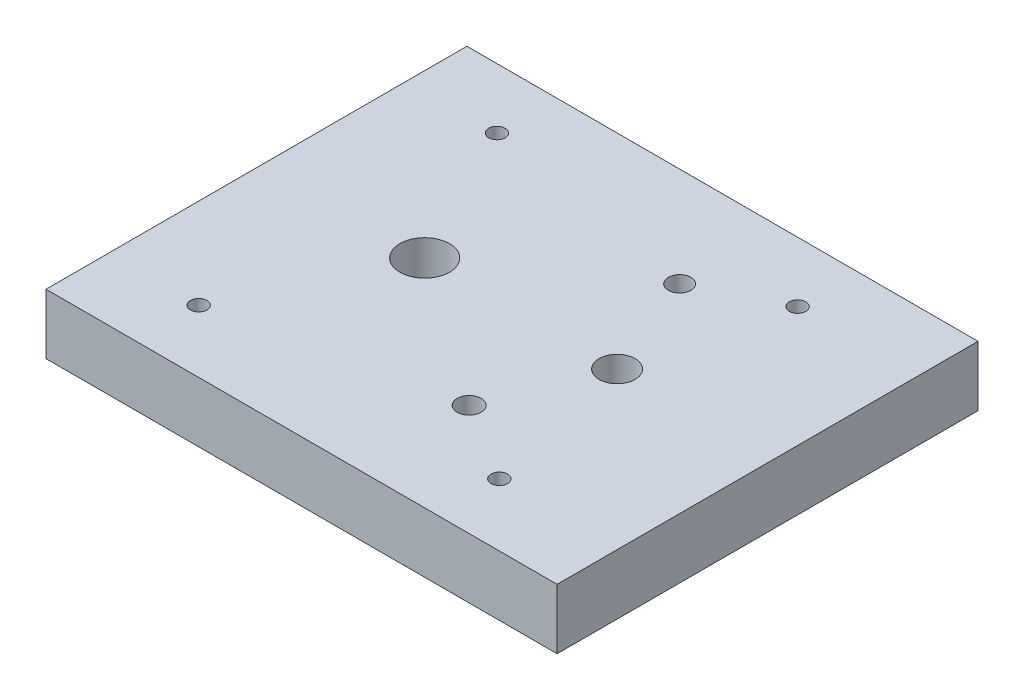
ISO-10303-21;
HEADER;
FILE_DESCRIPTION(('STEP AP214'),'2;1');
FILE_NAME('part.step','',(''),(''),'','','');
FILE_SCHEMA(('AUTOMOTIVE_DESIGN { 1 0 10303 214 1 1 1 1 }'));
ENDSEC;
DATA;
#1=APPLICATION_CONTEXT('core data for automotive mechanical design processes');
#2=APPLICATION_PROTOCOL_DEFINITION('international standard','automotive_design',2000,#1);
#3=PRODUCT_CONTEXT('',#1,'mechanical');
#4=PRODUCT('Part','Part','',(#3));
#5=PRODUCT_RELATED_PRODUCT_CATEGORY('part','',(#4));
#6=PRODUCT_DEFINITION_FORMATION('','',#4);
#7=PRODUCT_DEFINITION_CONTEXT('part definition',#1,'design');
#8=PRODUCT_DEFINITION('design','',#6,#7);
#9=PRODUCT_DEFINITION_SHAPE('','',#8);
#10=(LENGTH_UNIT() NAMED_UNIT(*) SI_UNIT(.MILLI.,.METRE.));
#11=(NAMED_UNIT(*) PLANE_ANGLE_UNIT() SI_UNIT($,.RADIAN.));
#12=(NAMED_UNIT(*) SI_UNIT($,.STERADIAN.) SOLID_ANGLE_UNIT());
#13=UNCERTAINTY_MEASURE_WITH_UNIT(LENGTH_MEASURE(1.E-05),#10,'distance_accuracy_value','');
#14=(GEOMETRIC_REPRESENTATION_CONTEXT(3) GLOBAL_UNCERTAINTY_ASSIGNED_CONTEXT((#13)) GLOBAL_UNIT_ASSIGNED_CONTEXT((#10,
#11,#12)) REPRESENTATION_CONTEXT('',''));
#15=CARTESIAN_POINT('',(0.,0.,0.));
#16=DIRECTION('',(0.,0.,1.));
#17=DIRECTION('',(1.,0.,0.));
#18=AXIS2_PLACEMENT_3D('',#15,#16,#17);
#19=CARTESIAN_POINT('',(42.5,10.,0.));
#20=DIRECTION('',(1.,0.,0.));
#21=DIRECTION('',(0.,0.,-1.));
#22=AXIS2_PLACEMENT_3D('',#19,#20,#21);
#23=PLANE('',#22);
#24=DIRECTION('',(0.,0.,1.));
#25=VECTOR('',#24,1.);
#26=CARTESIAN_POINT('',(42.5,0.,0.));
#27=LINE('',#26,#25);
#28=CARTESIAN_POINT('',(42.5,0.,-35.));
#29=VERTEX_POINT('',#28);
#30=CARTESIAN_POINT('',(42.5,0.,35.));
#31=VERTEX_POINT('',#30);
#32=EDGE_CURVE('E150',#29,#31,#27,.T.);
#33=ORIENTED_EDGE('',*,*,#32,.F.);
#34=DIRECTION('',(0.,-1.,0.));
#35=VECTOR('',#34,1.);
#36=CARTESIAN_POINT('',(42.5,10.,-35.));
#37=LINE('',#36,#35);
#38=CARTESIAN_POINT('',(42.5,10.,-35.));
#39=VERTEX_POINT('',#38);
#40=EDGE_CURVE('E11',#39,#29,#37,.T.);
#41=ORIENTED_EDGE('',*,*,#40,.F.);
#42=DIRECTION('',(0.,0.,1.));
#43=VECTOR('',#42,1.);
#44=CARTESIAN_POINT('',(42.5,10.,0.));
#45=LINE('',#44,#43);
#46=CARTESIAN_POINT('',(42.5,10.,35.));
#47=VERTEX_POINT('',#46);
#48=EDGE_CURVE('E108',#39,#47,#45,.T.);
#49=ORIENTED_EDGE('',*,*,#48,.T.);
#50=DIRECTION('',(0.,-1.,0.));
#51=VECTOR('',#50,1.);
#52=CARTESIAN_POINT('',(42.5,10.,35.));
#53=LINE('',#52,#51);
#54=EDGE_CURVE('E83',#47,#31,#53,.T.);
#55=ORIENTED_EDGE('',*,*,#54,.T.);
#56=EDGE_LOOP('',(#33,#41,#49,#55));
#57=FACE_BOUND('',#56,.T.);
#58=ADVANCED_FACE('F41',(#57),#23,.T.);
#59=CARTESIAN_POINT('',(0.,10.,-35.));
#60=DIRECTION('',(0.,0.,-1.));
#61=DIRECTION('',(-1.,0.,0.));
#62=AXIS2_PLACEMENT_3D('',#59,#60,#61);
#63=PLANE('',#62);
#64=DIRECTION('',(1.,0.,0.));
#65=VECTOR('',#64,1.);
#66=CARTESIAN_POINT('',(0.,0.,-35.));
#67=LINE('',#66,#65);
#68=CARTESIAN_POINT('',(-42.5,0.,-35.));
#69=VERTEX_POINT('',#68);
#70=EDGE_CURVE('E95',#69,#29,#67,.T.);
#71=ORIENTED_EDGE('',*,*,#70,.F.);
#72=DIRECTION('',(0.,-1.,0.));
#73=VECTOR('',#72,1.);
#74=CARTESIAN_POINT('',(-42.5,10.,-35.));
#75=LINE('',#74,#73);
#76=CARTESIAN_POINT('',(-42.5,10.,-35.));
#77=VERTEX_POINT('',#76);
#78=EDGE_CURVE('E52',#77,#69,#75,.T.);
#79=ORIENTED_EDGE('',*,*,#78,.F.);
#80=DIRECTION('',(1.,0.,0.));
#81=VECTOR('',#80,1.);
#82=CARTESIAN_POINT('',(0.,10.,-35.));
#83=LINE('',#82,#81);
#84=EDGE_CURVE('E93',#77,#39,#83,.T.);
#85=ORIENTED_EDGE('',*,*,#84,.T.);
#86=ORIENTED_EDGE('',*,*,#40,.T.);
#87=EDGE_LOOP('',(#71,#79,#85,#86));
#88=FACE_BOUND('',#87,.T.);
#89=ADVANCED_FACE('F91',(#88),#63,.T.);
#90=CARTESIAN_POINT('',(-42.5,10.,0.));
#91=DIRECTION('',(1.,0.,0.));
#92=DIRECTION('',(0.,0.,-1.));
#93=AXIS2_PLACEMENT_3D('',#90,#91,#92);
#94=PLANE('',#93);
#95=DIRECTION('',(0.,0.,1.));
#96=VECTOR('',#95,1.);
#97=CARTESIAN_POINT('',(-42.5,0.,0.));
#98=LINE('',#97,#96);
#99=CARTESIAN_POINT('',(-42.5,0.,35.));
#100=VERTEX_POINT('',#99);
#101=EDGE_CURVE('E155',#69,#100,#98,.T.);
#102=ORIENTED_EDGE('',*,*,#101,.T.);
#103=DIRECTION('',(0.,-1.,0.));
#104=VECTOR('',#103,1.);
#105=CARTESIAN_POINT('',(-42.5,10.,35.));
#106=LINE('',#105,#104);
#107=CARTESIAN_POINT('',(-42.5,10.,35.));
#108=VERTEX_POINT('',#107);
#109=EDGE_CURVE('E99',#108,#100,#106,.T.);
#110=ORIENTED_EDGE('',*,*,#109,.F.);
#111=DIRECTION('',(0.,0.,1.));
#112=VECTOR('',#111,1.);
#113=CARTESIAN_POINT('',(-42.5,10.,0.));
#114=LINE('',#113,#112);
#115=EDGE_CURVE('E102',#77,#108,#114,.T.);
#116=ORIENTED_EDGE('',*,*,#115,.F.);
#117=ORIENTED_EDGE('',*,*,#78,.T.);
#118=EDGE_LOOP('',(#102,#110,#116,#117));
#119=FACE_BOUND('',#118,.T.);
#120=ADVANCED_FACE('F103',(#119),#94,.F.);
#121=CARTESIAN_POINT('',(-15.52,10.,-0.999999999999982));
#122=DIRECTION('',(0.,-1.,0.));
#123=DIRECTION('',(0.,0.,-1.));
#124=AXIS2_PLACEMENT_3D('',#121,#122,#123);
#125=CYLINDRICAL_SURFACE('',#124,4.125);
#126=CARTESIAN_POINT('',(-15.52,10.,-0.999999999999982));
#127=DIRECTION('',(0.,1.,0.));
#128=DIRECTION('',(0.,0.,1.));
#129=AXIS2_PLACEMENT_3D('',#126,#127,#128);
#130=CIRCLE('',#129,4.125);
#131=CARTESIAN_POINT('',(-15.52,10.,3.12500000000002));
#132=VERTEX_POINT('',#131);
#133=EDGE_CURVE('E122',#132,#132,#130,.T.);
#134=ORIENTED_EDGE('',*,*,#133,.T.);
#135=EDGE_LOOP('',(#134));
#136=FACE_BOUND('',#135,.T.);
#137=CARTESIAN_POINT('',(-15.52,0.,-0.999999999999982));
#138=DIRECTION('',(0.,1.,0.));
#139=DIRECTION('',(0.,0.,1.));
#140=AXIS2_PLACEMENT_3D('',#137,#138,#139);
#141=CIRCLE('',#140,4.125);
#142=CARTESIAN_POINT('',(-15.52,0.,3.12500000000002));
#143=VERTEX_POINT('',#142);
#144=EDGE_CURVE('E164',#143,#143,#141,.T.);
#145=ORIENTED_EDGE('',*,*,#144,.F.);
#146=EDGE_LOOP('',(#145));
#147=FACE_BOUND('',#146,.T.);
#148=ADVANCED_FACE('F237',(#136,#147),#125,.F.);
#149=CARTESIAN_POINT('',(-27.5,10.,24.6066772895717));
#150=DIRECTION('',(0.,-1.,0.));
#151=DIRECTION('',(0.,0.,-1.));
#152=AXIS2_PLACEMENT_3D('',#149,#150,#151);
#153=CYLINDRICAL_SURFACE('',#152,1.375);
#154=CARTESIAN_POINT('',(-27.5,10.,24.6066772895717));
#155=DIRECTION('',(0.,1.,0.));
#156=DIRECTION('',(0.,0.,1.));
#157=AXIS2_PLACEMENT_3D('',#154,#155,#156);
#158=CIRCLE('',#157,1.375);
#159=CARTESIAN_POINT('',(-27.5,10.,25.9816772895717));
#160=VERTEX_POINT('',#159);
#161=EDGE_CURVE('E118',#160,#160,#158,.F.);
#162=ORIENTED_EDGE('',*,*,#161,.F.);
#163=EDGE_LOOP('',(#162));
#164=FACE_BOUND('',#163,.T.);
#165=CARTESIAN_POINT('',(-27.5,0.,24.6066772895717));
#166=DIRECTION('',(0.,1.,0.));
#167=DIRECTION('',(0.,0.,1.));
#168=AXIS2_PLACEMENT_3D('',#165,#166,#167);
#169=CIRCLE('',#168,1.375);
#170=CARTESIAN_POINT('',(-27.5,0.,25.9816772895717));
#171=VERTEX_POINT('',#170);
#172=EDGE_CURVE('E160',#171,#171,#169,.F.);
#173=ORIENTED_EDGE('',*,*,#172,.T.);
#174=EDGE_LOOP('',(#173));
#175=FACE_BOUND('',#174,.T.);
#176=ADVANCED_FACE('F240',(#164,#175),#153,.F.);
#177=CARTESIAN_POINT('',(0.,10.,35.));
#178=DIRECTION('',(0.,0.,-1.));
#179=DIRECTION('',(-1.,0.,0.));
#180=AXIS2_PLACEMENT_3D('',#177,#178,#179);
#181=PLANE('',#180);
#182=DIRECTION('',(1.,0.,0.));
#183=VECTOR('',#182,1.);
#184=CARTESIAN_POINT('',(0.,0.,35.));
#185=LINE('',#184,#183);
#186=EDGE_CURVE('E76',#100,#31,#185,.T.);
#187=ORIENTED_EDGE('',*,*,#186,.T.);
#188=ORIENTED_EDGE('',*,*,#54,.F.);
#189=DIRECTION('',(1.,0.,0.));
#190=VECTOR('',#189,1.);
#191=CARTESIAN_POINT('',(0.,10.,35.));
#192=LINE('',#191,#190);
#193=EDGE_CURVE('E60',#108,#47,#192,.T.);
#194=ORIENTED_EDGE('',*,*,#193,.F.);
#195=ORIENTED_EDGE('',*,*,#109,.T.);
#196=EDGE_LOOP('',(#187,#188,#194,#195));
#197=FACE_BOUND('',#196,.T.);
#198=ADVANCED_FACE('F173',(#197),#181,.F.);
#199=CARTESIAN_POINT('',(-27.5,10.,-25.));
#200=DIRECTION('',(0.,-1.,0.));
#201=DIRECTION('',(0.,0.,-1.));
#202=AXIS2_PLACEMENT_3D('',#199,#200,#201);
#203=CYLINDRICAL_SURFACE('',#202,1.375);
#204=CARTESIAN_POINT('',(-27.5,10.,-25.));
#205=DIRECTION('',(0.,1.,0.));
#206=DIRECTION('',(0.,0.,1.));
#207=AXIS2_PLACEMENT_3D('',#204,#205,#206);
#208=CIRCLE('',#207,1.375);
#209=CARTESIAN_POINT('',(-27.5,10.,-23.625));
#210=VERTEX_POINT('',#209);
#211=EDGE_CURVE('E112',#210,#210,#208,.T.);
#212=ORIENTED_EDGE('',*,*,#211,.T.);
#213=EDGE_LOOP('',(#212));
#214=FACE_BOUND('',#213,.T.);
#215=CARTESIAN_POINT('',(-27.5,0.,-25.));
#216=DIRECTION('',(0.,1.,0.));
#217=DIRECTION('',(0.,0.,1.));
#218=AXIS2_PLACEMENT_3D('',#215,#216,#217);
#219=CIRCLE('',#218,1.375);
#220=CARTESIAN_POINT('',(-27.5,0.,-23.625));
#221=VERTEX_POINT('',#220);
#222=EDGE_CURVE('E146',#221,#221,#219,.T.);
#223=ORIENTED_EDGE('',*,*,#222,.F.);
#224=EDGE_LOOP('',(#223));
#225=FACE_BOUND('',#224,.T.);
#226=ADVANCED_FACE('F184',(#214,#225),#203,.F.);
#227=CARTESIAN_POINT('',(22.5,10.,-25.));
#228=DIRECTION('',(0.,-1.,0.));
#229=DIRECTION('',(0.,0.,-1.));
#230=AXIS2_PLACEMENT_3D('',#227,#228,#229);
#231=CYLINDRICAL_SURFACE('',#230,1.375);
#232=CARTESIAN_POINT('',(22.5,10.,-25.));
#233=DIRECTION('',(0.,1.,0.));
#234=DIRECTION('',(0.,0.,1.));
#235=AXIS2_PLACEMENT_3D('',#232,#233,#234);
#236=CIRCLE('',#235,1.375);
#237=CARTESIAN_POINT('',(22.5,10.,-23.625));
#238=VERTEX_POINT('',#237);
#239=EDGE_CURVE('E346',#238,#238,#236,.T.);
#240=ORIENTED_EDGE('',*,*,#239,.T.);
#241=EDGE_LOOP('',(#240));
#242=FACE_BOUND('',#241,.T.);
#243=CARTESIAN_POINT('',(22.5,0.,-25.));
#244=DIRECTION('',(0.,1.,0.));
#245=DIRECTION('',(0.,0.,1.));
#246=AXIS2_PLACEMENT_3D('',#243,#244,#245);
#247=CIRCLE('',#246,1.375);
#248=CARTESIAN_POINT('',(22.5,0.,-23.625));
#249=VERTEX_POINT('',#248);
#250=EDGE_CURVE('E142',#249,#249,#247,.T.);
#251=ORIENTED_EDGE('',*,*,#250,.F.);
#252=EDGE_LOOP('',(#251));
#253=FACE_BOUND('',#252,.T.);
#254=ADVANCED_FACE('F187',(#242,#253),#231,.F.);
#255=CARTESIAN_POINT('',(22.5,10.,24.6066772895717));
#256=DIRECTION('',(0.,-1.,0.));
#257=DIRECTION('',(0.,0.,-1.));
#258=AXIS2_PLACEMENT_3D('',#255,#256,#257);
#259=CYLINDRICAL_SURFACE('',#258,1.375);
#260=CARTESIAN_POINT('',(22.5,10.,24.6066772895717));
#261=DIRECTION('',(0.,1.,0.));
#262=DIRECTION('',(0.,0.,1.));
#263=AXIS2_PLACEMENT_3D('',#260,#261,#262);
#264=CIRCLE('',#263,1.375);
#265=CARTESIAN_POINT('',(22.5,10.,25.9816772895717));
#266=VERTEX_POINT('',#265);
#267=EDGE_CURVE('E342',#266,#266,#264,.F.);
#268=ORIENTED_EDGE('',*,*,#267,.F.);
#269=EDGE_LOOP('',(#268));
#270=FACE_BOUND('',#269,.T.);
#271=CARTESIAN_POINT('',(22.5,0.,24.6066772895717));
#272=DIRECTION('',(0.,1.,0.));
#273=DIRECTION('',(0.,0.,1.));
#274=AXIS2_PLACEMENT_3D('',#271,#272,#273);
#275=CIRCLE('',#274,1.375);
#276=CARTESIAN_POINT('',(22.5,0.,25.9816772895717));
#277=VERTEX_POINT('',#276);
#278=EDGE_CURVE('E138',#277,#277,#275,.F.);
#279=ORIENTED_EDGE('',*,*,#278,.T.);
#280=EDGE_LOOP('',(#279));
#281=FACE_BOUND('',#280,.T.);
#282=ADVANCED_FACE('F191',(#270,#281),#259,.F.);
#283=CARTESIAN_POINT('',(9.40721105156996,10.,-18.4710430680431));
#284=DIRECTION('',(0.,-1.,0.));
#285=DIRECTION('',(0.,0.,-1.));
#286=AXIS2_PLACEMENT_3D('',#283,#284,#285);
#287=CYLINDRICAL_SURFACE('',#286,1.875);
#288=CARTESIAN_POINT('',(9.40721105156996,10.,-18.4710430680431));
#289=DIRECTION('',(0.,1.,0.));
#290=DIRECTION('',(0.,0.,1.));
#291=AXIS2_PLACEMENT_3D('',#288,#289,#290);
#292=CIRCLE('',#291,1.875);
#293=CARTESIAN_POINT('',(9.40721105156996,10.,-16.5960430680431));
#294=VERTEX_POINT('',#293);
#295=EDGE_CURVE('E206',#294,#294,#292,.T.);
#296=ORIENTED_EDGE('',*,*,#295,.T.);
#297=EDGE_LOOP('',(#296));
#298=FACE_BOUND('',#297,.T.);
#299=CARTESIAN_POINT('',(9.40721105156996,0.,-18.4710430680431));
#300=DIRECTION('',(0.,1.,0.));
#301=DIRECTION('',(0.,0.,1.));
#302=AXIS2_PLACEMENT_3D('',#299,#300,#301);
#303=CIRCLE('',#302,1.875);
#304=CARTESIAN_POINT('',(9.40721105156996,0.,-16.5960430680431));
#305=VERTEX_POINT('',#304);
#306=EDGE_CURVE('E134',#305,#305,#303,.T.);
#307=ORIENTED_EDGE('',*,*,#306,.F.);
#308=EDGE_LOOP('',(#307));
#309=FACE_BOUND('',#308,.T.);
#310=ADVANCED_FACE('F194',(#298,#309),#287,.F.);
#311=CARTESIAN_POINT('',(9.40139824124155,10.,16.5289564492602));
#312=DIRECTION('',(0.,-1.,0.));
#313=DIRECTION('',(0.,0.,-1.));
#314=AXIS2_PLACEMENT_3D('',#311,#312,#313);
#315=CYLINDRICAL_SURFACE('',#314,2.);
#316=CARTESIAN_POINT('',(9.40139824124155,10.,16.5289564492602));
#317=DIRECTION('',(0.,1.,0.));
#318=DIRECTION('',(0.,0.,1.));
#319=AXIS2_PLACEMENT_3D('',#316,#317,#318);
#320=CIRCLE('',#319,2.);
#321=CARTESIAN_POINT('',(9.40139824124155,10.,18.5289564492602));
#322=VERTEX_POINT('',#321);
#323=EDGE_CURVE('E168',#322,#322,#320,.T.);
#324=ORIENTED_EDGE('',*,*,#323,.T.);
#325=EDGE_LOOP('',(#324));
#326=FACE_BOUND('',#325,.T.);
#327=CARTESIAN_POINT('',(9.40139824124155,0.,16.5289564492602));
#328=DIRECTION('',(0.,1.,0.));
#329=DIRECTION('',(0.,0.,1.));
#330=AXIS2_PLACEMENT_3D('',#327,#328,#329);
#331=CIRCLE('',#330,2.);
#332=CARTESIAN_POINT('',(9.40139824124155,0.,18.5289564492602));
#333=VERTEX_POINT('',#332);
#334=EDGE_CURVE('E130',#333,#333,#331,.T.);
#335=ORIENTED_EDGE('',*,*,#334,.F.);
#336=EDGE_LOOP('',(#335));
#337=FACE_BOUND('',#336,.T.);
#338=ADVANCED_FACE('F43',(#326,#337),#315,.F.);
#339=CARTESIAN_POINT('',(16.4783394877401,10.,-0.999882702112446));
#340=DIRECTION('',(0.,-1.,0.));
#341=DIRECTION('',(0.,0.,-1.));
#342=AXIS2_PLACEMENT_3D('',#339,#340,#341);
#343=CYLINDRICAL_SURFACE('',#342,2.99999999999999);
#344=CARTESIAN_POINT('',(16.4783394877401,2.,-0.999882702112446));
#345=DIRECTION('',(0.,1.,0.));
#346=DIRECTION('',(0.,0.,1.));
#347=AXIS2_PLACEMENT_3D('',#344,#345,#346);
#348=CIRCLE('',#347,2.99999999999999);
#349=CARTESIAN_POINT('',(16.4783394877401,2.,2.00011729788755));
#350=VERTEX_POINT('',#349);
#351=EDGE_CURVE('E45',#350,#350,#348,.T.);
#352=ORIENTED_EDGE('',*,*,#351,.F.);
#353=EDGE_LOOP('',(#352));
#354=FACE_BOUND('',#353,.T.);
#355=CARTESIAN_POINT('',(16.4783394877401,10.,-0.999882702112446));
#356=DIRECTION('',(0.,1.,0.));
#357=DIRECTION('',(0.,0.,1.));
#358=AXIS2_PLACEMENT_3D('',#355,#356,#357);
#359=CIRCLE('',#358,2.99999999999999);
#360=CARTESIAN_POINT('',(16.4783394877401,10.,2.00011729788755));
#361=VERTEX_POINT('',#360);
#362=EDGE_CURVE('E126',#361,#361,#359,.T.);
#363=ORIENTED_EDGE('',*,*,#362,.T.);
#364=EDGE_LOOP('',(#363));
#365=FACE_BOUND('',#364,.T.);
#366=ADVANCED_FACE('F201',(#354,#365),#343,.F.);
#367=CARTESIAN_POINT('',(0.,10.,0.));
#368=DIRECTION('',(0.,1.,0.));
#369=DIRECTION('',(0.,0.,1.));
#370=AXIS2_PLACEMENT_3D('',#367,#368,#369);
#371=PLANE('',#370);
#372=ORIENTED_EDGE('',*,*,#323,.F.);
#373=EDGE_LOOP('',(#372));
#374=FACE_BOUND('',#373,.T.);
#375=ORIENTED_EDGE('',*,*,#295,.F.);
#376=EDGE_LOOP('',(#375));
#377=FACE_BOUND('',#376,.T.);
#378=ORIENTED_EDGE('',*,*,#267,.T.);
#379=EDGE_LOOP('',(#378));
#380=FACE_BOUND('',#379,.T.);
#381=ORIENTED_EDGE('',*,*,#239,.F.);
#382=EDGE_LOOP('',(#381));
#383=FACE_BOUND('',#382,.T.);
#384=ORIENTED_EDGE('',*,*,#211,.F.);
#385=EDGE_LOOP('',(#384));
#386=FACE_BOUND('',#385,.T.);
#387=ORIENTED_EDGE('',*,*,#48,.F.);
#388=ORIENTED_EDGE('',*,*,#84,.F.);
#389=ORIENTED_EDGE('',*,*,#115,.T.);
#390=ORIENTED_EDGE('',*,*,#193,.T.);
#391=EDGE_LOOP('',(#387,#388,#389,#390));
#392=FACE_BOUND('',#391,.T.);
#393=ORIENTED_EDGE('',*,*,#161,.T.);
#394=EDGE_LOOP('',(#393));
#395=FACE_BOUND('',#394,.T.);
#396=ORIENTED_EDGE('',*,*,#133,.F.);
#397=EDGE_LOOP('',(#396));
#398=FACE_BOUND('',#397,.T.);
#399=ORIENTED_EDGE('',*,*,#362,.F.);
#400=EDGE_LOOP('',(#399));
#401=FACE_BOUND('',#400,.T.);
#402=ADVANCED_FACE('F106',(#374,#377,#380,#383,#386,#392,#395,#398,#401),#371,.T.);
#403=CARTESIAN_POINT('',(0.,0.,0.));
#404=DIRECTION('',(0.,1.,0.));
#405=DIRECTION('',(0.,0.,1.));
#406=AXIS2_PLACEMENT_3D('',#403,#404,#405);
#407=PLANE('',#406);
#408=CARTESIAN_POINT('',(16.4783394877401,0.,-0.999882702112446));
#409=DIRECTION('',(0.,1.,0.));
#410=DIRECTION('',(0.,0.,1.));
#411=AXIS2_PLACEMENT_3D('',#408,#409,#410);
#412=CIRCLE('',#411,4.5);
#413=CARTESIAN_POINT('',(16.4783394877401,0.,3.50011729788756));
#414=VERTEX_POINT('',#413);
#415=EDGE_CURVE('E331',#414,#414,#412,.T.);
#416=ORIENTED_EDGE('',*,*,#415,.T.);
#417=EDGE_LOOP('',(#416));
#418=FACE_BOUND('',#417,.T.);
#419=ORIENTED_EDGE('',*,*,#334,.T.);
#420=EDGE_LOOP('',(#419));
#421=FACE_BOUND('',#420,.T.);
#422=ORIENTED_EDGE('',*,*,#306,.T.);
#423=EDGE_LOOP('',(#422));
#424=FACE_BOUND('',#423,.T.);
#425=ORIENTED_EDGE('',*,*,#278,.F.);
#426=EDGE_LOOP('',(#425));
#427=FACE_BOUND('',#426,.T.);
#428=ORIENTED_EDGE('',*,*,#250,.T.);
#429=EDGE_LOOP('',(#428));
#430=FACE_BOUND('',#429,.T.);
#431=ORIENTED_EDGE('',*,*,#222,.T.);
#432=EDGE_LOOP('',(#431));
#433=FACE_BOUND('',#432,.T.);
#434=ORIENTED_EDGE('',*,*,#32,.T.);
#435=ORIENTED_EDGE('',*,*,#186,.F.);
#436=ORIENTED_EDGE('',*,*,#101,.F.);
#437=ORIENTED_EDGE('',*,*,#70,.T.);
#438=EDGE_LOOP('',(#434,#435,#436,#437));
#439=FACE_BOUND('',#438,.T.);
#440=ORIENTED_EDGE('',*,*,#172,.F.);
#441=EDGE_LOOP('',(#440));
#442=FACE_BOUND('',#441,.T.);
#443=ORIENTED_EDGE('',*,*,#144,.T.);
#444=EDGE_LOOP('',(#443));
#445=FACE_BOUND('',#444,.T.);
#446=ADVANCED_FACE('F174',(#418,#421,#424,#427,#430,#433,#439,#442,#445),#407,.F.);
#447=CARTESIAN_POINT('',(16.4783394877401,2.,-0.999882702112446));
#448=DIRECTION('',(0.,-1.,0.));
#449=DIRECTION('',(0.,0.,-1.));
#450=AXIS2_PLACEMENT_3D('',#447,#448,#449);
#451=CYLINDRICAL_SURFACE('',#450,4.5);
#452=CARTESIAN_POINT('',(16.4783394877401,2.,-0.999882702112446));
#453=DIRECTION('',(0.,1.,0.));
#454=DIRECTION('',(0.,0.,1.));
#455=AXIS2_PLACEMENT_3D('',#452,#453,#454);
#456=CIRCLE('',#455,4.5);
#457=CARTESIAN_POINT('',(16.4783394877401,2.,3.50011729788756));
#458=VERTEX_POINT('',#457);
#459=EDGE_CURVE('E329',#458,#458,#456,.T.);
#460=ORIENTED_EDGE('',*,*,#459,.T.);
#461=EDGE_LOOP('',(#460));
#462=FACE_BOUND('',#461,.T.);
#463=ORIENTED_EDGE('',*,*,#415,.F.);
#464=EDGE_LOOP('',(#463));
#465=FACE_BOUND('',#464,.T.);
#466=ADVANCED_FACE('F211',(#462,#465),#451,.F.);
#467=CARTESIAN_POINT('',(16.4783394877401,2.,-0.999882702112446));
#468=DIRECTION('',(0.,1.,0.));
#469=DIRECTION('',(0.,0.,1.));
#470=AXIS2_PLACEMENT_3D('',#467,#468,#469);
#471=PLANE('',#470);
#472=ORIENTED_EDGE('',*,*,#351,.T.);
#473=EDGE_LOOP('',(#472));
#474=FACE_BOUND('',#473,.T.);
#475=ORIENTED_EDGE('',*,*,#459,.F.);
#476=EDGE_LOOP('',(#475));
#477=FACE_BOUND('',#476,.T.);
#478=ADVANCED_FACE('F226',(#474,#477),#471,.F.);
#479=CLOSED_SHELL('',(#58,#89,#120,#148,#176,#198,#226,#254,#282,#310,#338,#366,#402,#446,#466,#478));
#480=MANIFOLD_SOLID_BREP('B2',#479);
#481=ADVANCED_BREP_SHAPE_REPRESENTATION('',(#18,#480),#14);
#482=SHAPE_DEFINITION_REPRESENTATION(#9,#481);
ENDSEC;
END-ISO-10303-21;
